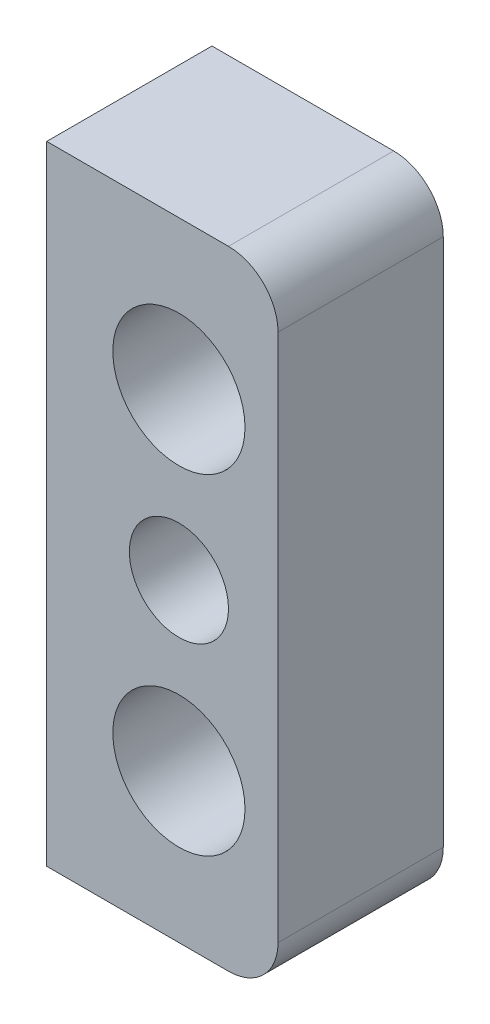
ISO-10303-21;
HEADER;
FILE_DESCRIPTION(('STEP AP214'),'2;1');
FILE_NAME('part.step','',(''),(''),'','','');
FILE_SCHEMA(('AUTOMOTIVE_DESIGN { 1 0 10303 214 1 1 1 1 }'));
ENDSEC;
DATA;
#1=APPLICATION_CONTEXT('core data for automotive mechanical design processes');
#2=APPLICATION_PROTOCOL_DEFINITION('international standard','automotive_design',2000,#1);
#3=PRODUCT_CONTEXT('',#1,'mechanical');
#4=PRODUCT('Part','Part','',(#3));
#5=PRODUCT_RELATED_PRODUCT_CATEGORY('part','',(#4));
#6=PRODUCT_DEFINITION_FORMATION('','',#4);
#7=PRODUCT_DEFINITION_CONTEXT('part definition',#1,'design');
#8=PRODUCT_DEFINITION('design','',#6,#7);
#9=PRODUCT_DEFINITION_SHAPE('','',#8);
#10=(LENGTH_UNIT() NAMED_UNIT(*) SI_UNIT(.MILLI.,.METRE.));
#11=(NAMED_UNIT(*) PLANE_ANGLE_UNIT() SI_UNIT($,.RADIAN.));
#12=(NAMED_UNIT(*) SI_UNIT($,.STERADIAN.) SOLID_ANGLE_UNIT());
#13=UNCERTAINTY_MEASURE_WITH_UNIT(LENGTH_MEASURE(1.E-05),#10,'distance_accuracy_value','');
#14=(GEOMETRIC_REPRESENTATION_CONTEXT(3) GLOBAL_UNCERTAINTY_ASSIGNED_CONTEXT((#13)) GLOBAL_UNIT_ASSIGNED_CONTEXT((#10,
#11,#12)) REPRESENTATION_CONTEXT('',''));
#15=CARTESIAN_POINT('',(0.,0.,0.));
#16=DIRECTION('',(0.,0.,1.));
#17=DIRECTION('',(1.,0.,0.));
#18=AXIS2_PLACEMENT_3D('',#15,#16,#17);
#19=CARTESIAN_POINT('',(20.,-9.49999999999999,-5.));
#20=DIRECTION('',(0.,-1.,0.));
#21=DIRECTION('',(0.,0.,-1.));
#22=AXIS2_PLACEMENT_3D('',#19,#20,#21);
#23=PLANE('',#22);
#24=DIRECTION('',(1.,0.,0.));
#25=VECTOR('',#24,1.);
#26=CARTESIAN_POINT('',(20.,-9.49999999999999,0.));
#27=LINE('',#26,#25);
#28=CARTESIAN_POINT('',(20.,-9.49999999999999,0.));
#29=VERTEX_POINT('',#28);
#30=CARTESIAN_POINT('',(25.5,-9.49999999999999,0.));
#31=VERTEX_POINT('',#30);
#32=EDGE_CURVE('E118',#29,#31,#27,.T.);
#33=ORIENTED_EDGE('',*,*,#32,.F.);
#34=DIRECTION('',(0.,0.,1.));
#35=VECTOR('',#34,1.);
#36=CARTESIAN_POINT('',(20.,-9.49999999999999,-5.));
#37=LINE('',#36,#35);
#38=CARTESIAN_POINT('',(20.,-9.49999999999999,-5.));
#39=VERTEX_POINT('',#38);
#40=EDGE_CURVE('E11',#39,#29,#37,.T.);
#41=ORIENTED_EDGE('',*,*,#40,.F.);
#42=DIRECTION('',(1.,0.,0.));
#43=VECTOR('',#42,1.);
#44=CARTESIAN_POINT('',(20.,-9.49999999999999,-5.));
#45=LINE('',#44,#43);
#46=CARTESIAN_POINT('',(25.5,-9.49999999999999,-5.));
#47=VERTEX_POINT('',#46);
#48=EDGE_CURVE('E133',#39,#47,#45,.T.);
#49=ORIENTED_EDGE('',*,*,#48,.T.);
#50=DIRECTION('',(0.,0.,1.));
#51=VECTOR('',#50,1.);
#52=CARTESIAN_POINT('',(25.5,-9.49999999999999,-5.));
#53=LINE('',#52,#51);
#54=EDGE_CURVE('E36',#47,#31,#53,.T.);
#55=ORIENTED_EDGE('',*,*,#54,.T.);
#56=EDGE_LOOP('',(#33,#41,#49,#55));
#57=FACE_BOUND('',#56,.T.);
#58=ADVANCED_FACE('F33',(#57),#23,.T.);
#59=CARTESIAN_POINT('',(20.,-9.49999999999999,-5.));
#60=DIRECTION('',(-1.,0.,0.));
#61=DIRECTION('',(0.,0.,1.));
#62=AXIS2_PLACEMENT_3D('',#59,#60,#61);
#63=PLANE('',#62);
#64=DIRECTION('',(0.,-1.,0.));
#65=VECTOR('',#64,1.);
#66=CARTESIAN_POINT('',(20.,-9.49999999999999,0.));
#67=LINE('',#66,#65);
#68=CARTESIAN_POINT('',(20.,9.5,0.));
#69=VERTEX_POINT('',#68);
#70=EDGE_CURVE('E131',#69,#29,#67,.T.);
#71=ORIENTED_EDGE('',*,*,#70,.F.);
#72=DIRECTION('',(0.,0.,1.));
#73=VECTOR('',#72,1.);
#74=CARTESIAN_POINT('',(20.,9.5,-5.));
#75=LINE('',#74,#73);
#76=CARTESIAN_POINT('',(20.,9.5,-5.));
#77=VERTEX_POINT('',#76);
#78=EDGE_CURVE('E42',#77,#69,#75,.T.);
#79=ORIENTED_EDGE('',*,*,#78,.F.);
#80=DIRECTION('',(0.,-1.,0.));
#81=VECTOR('',#80,1.);
#82=CARTESIAN_POINT('',(20.,-9.49999999999999,-5.));
#83=LINE('',#82,#81);
#84=EDGE_CURVE('E108',#77,#39,#83,.T.);
#85=ORIENTED_EDGE('',*,*,#84,.T.);
#86=ORIENTED_EDGE('',*,*,#40,.T.);
#87=EDGE_LOOP('',(#71,#79,#85,#86));
#88=FACE_BOUND('',#87,.T.);
#89=ADVANCED_FACE('F141',(#88),#63,.T.);
#90=CARTESIAN_POINT('',(20.,9.5,-5.));
#91=DIRECTION('',(0.,1.,0.));
#92=DIRECTION('',(0.,0.,1.));
#93=AXIS2_PLACEMENT_3D('',#90,#91,#92);
#94=PLANE('',#93);
#95=DIRECTION('',(-1.,0.,0.));
#96=VECTOR('',#95,1.);
#97=CARTESIAN_POINT('',(20.,9.5,0.));
#98=LINE('',#97,#96);
#99=CARTESIAN_POINT('',(25.5,9.5,0.));
#100=VERTEX_POINT('',#99);
#101=EDGE_CURVE('E95',#100,#69,#98,.T.);
#102=ORIENTED_EDGE('',*,*,#101,.F.);
#103=DIRECTION('',(0.,0.,1.));
#104=VECTOR('',#103,1.);
#105=CARTESIAN_POINT('',(25.5,9.5,-5.));
#106=LINE('',#105,#104);
#107=CARTESIAN_POINT('',(25.5,9.5,-5.));
#108=VERTEX_POINT('',#107);
#109=EDGE_CURVE('E90',#108,#100,#106,.T.);
#110=ORIENTED_EDGE('',*,*,#109,.F.);
#111=DIRECTION('',(-1.,0.,0.));
#112=VECTOR('',#111,1.);
#113=CARTESIAN_POINT('',(20.,9.5,-5.));
#114=LINE('',#113,#112);
#115=EDGE_CURVE('E93',#108,#77,#114,.T.);
#116=ORIENTED_EDGE('',*,*,#115,.T.);
#117=ORIENTED_EDGE('',*,*,#78,.T.);
#118=EDGE_LOOP('',(#102,#110,#116,#117));
#119=FACE_BOUND('',#118,.T.);
#120=ADVANCED_FACE('F92',(#119),#94,.T.);
#121=CARTESIAN_POINT('',(25.5,8.,-5.));
#122=DIRECTION('',(0.,0.,1.));
#123=DIRECTION('',(1.,0.,0.));
#124=AXIS2_PLACEMENT_3D('',#121,#122,#123);
#125=CYLINDRICAL_SURFACE('',#124,1.5);
#126=CARTESIAN_POINT('',(25.5,8.,0.));
#127=DIRECTION('',(0.,0.,1.));
#128=DIRECTION('',(-1.,0.,0.));
#129=AXIS2_PLACEMENT_3D('',#126,#127,#128);
#130=CIRCLE('',#129,1.5);
#131=CARTESIAN_POINT('',(27.,7.99999999999999,0.));
#132=VERTEX_POINT('',#131);
#133=EDGE_CURVE('E128',#132,#100,#130,.T.);
#134=ORIENTED_EDGE('',*,*,#133,.F.);
#135=DIRECTION('',(0.,0.,1.));
#136=VECTOR('',#135,1.);
#137=CARTESIAN_POINT('',(27.,7.99999999999999,-5.));
#138=LINE('',#137,#136);
#139=CARTESIAN_POINT('',(27.,7.99999999999999,-5.));
#140=VERTEX_POINT('',#139);
#141=EDGE_CURVE('E100',#140,#132,#138,.T.);
#142=ORIENTED_EDGE('',*,*,#141,.F.);
#143=CARTESIAN_POINT('',(25.5,8.,-5.));
#144=DIRECTION('',(0.,0.,1.));
#145=DIRECTION('',(-1.,0.,0.));
#146=AXIS2_PLACEMENT_3D('',#143,#144,#145);
#147=CIRCLE('',#146,1.5);
#148=EDGE_CURVE('E106',#140,#108,#147,.T.);
#149=ORIENTED_EDGE('',*,*,#148,.T.);
#150=ORIENTED_EDGE('',*,*,#109,.T.);
#151=EDGE_LOOP('',(#134,#142,#149,#150));
#152=FACE_BOUND('',#151,.T.);
#153=ADVANCED_FACE('F110',(#152),#125,.T.);
#154=CARTESIAN_POINT('',(27.,-7.99999999999998,-5.));
#155=DIRECTION('',(1.,0.,0.));
#156=DIRECTION('',(0.,0.,-1.));
#157=AXIS2_PLACEMENT_3D('',#154,#155,#156);
#158=PLANE('',#157);
#159=DIRECTION('',(0.,1.,0.));
#160=VECTOR('',#159,1.);
#161=CARTESIAN_POINT('',(27.,-7.99999999999998,0.));
#162=LINE('',#161,#160);
#163=CARTESIAN_POINT('',(27.,-7.99999999999998,0.));
#164=VERTEX_POINT('',#163);
#165=EDGE_CURVE('E125',#164,#132,#162,.T.);
#166=ORIENTED_EDGE('',*,*,#165,.F.);
#167=DIRECTION('',(0.,0.,1.));
#168=VECTOR('',#167,1.);
#169=CARTESIAN_POINT('',(27.,-7.99999999999998,-5.));
#170=LINE('',#169,#168);
#171=CARTESIAN_POINT('',(27.,-7.99999999999998,-5.));
#172=VERTEX_POINT('',#171);
#173=EDGE_CURVE('E136',#172,#164,#170,.T.);
#174=ORIENTED_EDGE('',*,*,#173,.F.);
#175=DIRECTION('',(0.,1.,0.));
#176=VECTOR('',#175,1.);
#177=CARTESIAN_POINT('',(27.,-7.99999999999998,-5.));
#178=LINE('',#177,#176);
#179=EDGE_CURVE('E111',#172,#140,#178,.T.);
#180=ORIENTED_EDGE('',*,*,#179,.T.);
#181=ORIENTED_EDGE('',*,*,#141,.T.);
#182=EDGE_LOOP('',(#166,#174,#180,#181));
#183=FACE_BOUND('',#182,.T.);
#184=ADVANCED_FACE('F154',(#183),#158,.T.);
#185=CARTESIAN_POINT('',(25.5,-7.99999999999999,-5.));
#186=DIRECTION('',(0.,0.,1.));
#187=DIRECTION('',(1.,0.,0.));
#188=AXIS2_PLACEMENT_3D('',#185,#186,#187);
#189=CYLINDRICAL_SURFACE('',#188,1.5);
#190=CARTESIAN_POINT('',(25.5,-7.99999999999999,0.));
#191=DIRECTION('',(0.,0.,1.));
#192=DIRECTION('',(1.,0.,0.));
#193=AXIS2_PLACEMENT_3D('',#190,#191,#192);
#194=CIRCLE('',#193,1.5);
#195=EDGE_CURVE('E121',#31,#164,#194,.T.);
#196=ORIENTED_EDGE('',*,*,#195,.F.);
#197=ORIENTED_EDGE('',*,*,#54,.F.);
#198=CARTESIAN_POINT('',(25.5,-7.99999999999999,-5.));
#199=DIRECTION('',(0.,0.,1.));
#200=DIRECTION('',(1.,0.,0.));
#201=AXIS2_PLACEMENT_3D('',#198,#199,#200);
#202=CIRCLE('',#201,1.5);
#203=EDGE_CURVE('E113',#47,#172,#202,.T.);
#204=ORIENTED_EDGE('',*,*,#203,.T.);
#205=ORIENTED_EDGE('',*,*,#173,.T.);
#206=EDGE_LOOP('',(#196,#197,#204,#205));
#207=FACE_BOUND('',#206,.T.);
#208=ADVANCED_FACE('F138',(#207),#189,.T.);
#209=CARTESIAN_POINT('',(25.5,-7.99999999999999,-5.));
#210=DIRECTION('',(0.,0.,1.));
#211=DIRECTION('',(1.,0.,0.));
#212=AXIS2_PLACEMENT_3D('',#209,#210,#211);
#213=PLANE('',#212);
#214=CARTESIAN_POINT('',(24.,0.,-5.));
#215=DIRECTION('',(0.,0.,1.));
#216=DIRECTION('',(1.,0.,0.));
#217=AXIS2_PLACEMENT_3D('',#214,#215,#216);
#218=CIRCLE('',#217,1.5);
#219=CARTESIAN_POINT('',(25.5,0.,-5.));
#220=VERTEX_POINT('',#219);
#221=EDGE_CURVE('E184',#220,#220,#218,.T.);
#222=ORIENTED_EDGE('',*,*,#221,.T.);
#223=EDGE_LOOP('',(#222));
#224=FACE_BOUND('',#223,.T.);
#225=CARTESIAN_POINT('',(24.,-5.,-5.));
#226=DIRECTION('',(0.,0.,1.));
#227=DIRECTION('',(1.,0.,0.));
#228=AXIS2_PLACEMENT_3D('',#225,#226,#227);
#229=CIRCLE('',#228,2.00000000000001);
#230=CARTESIAN_POINT('',(26.,-5.,-5.));
#231=VERTEX_POINT('',#230);
#232=EDGE_CURVE('E192',#231,#231,#229,.T.);
#233=ORIENTED_EDGE('',*,*,#232,.T.);
#234=EDGE_LOOP('',(#233));
#235=FACE_BOUND('',#234,.T.);
#236=CARTESIAN_POINT('',(24.,5.,-5.));
#237=DIRECTION('',(0.,0.,1.));
#238=DIRECTION('',(1.,0.,0.));
#239=AXIS2_PLACEMENT_3D('',#236,#237,#238);
#240=CIRCLE('',#239,1.99999999999999);
#241=CARTESIAN_POINT('',(26.,5.,-5.));
#242=VERTEX_POINT('',#241);
#243=EDGE_CURVE('E122',#242,#242,#240,.T.);
#244=ORIENTED_EDGE('',*,*,#243,.T.);
#245=EDGE_LOOP('',(#244));
#246=FACE_BOUND('',#245,.T.);
#247=ORIENTED_EDGE('',*,*,#48,.F.);
#248=ORIENTED_EDGE('',*,*,#84,.F.);
#249=ORIENTED_EDGE('',*,*,#115,.F.);
#250=ORIENTED_EDGE('',*,*,#148,.F.);
#251=ORIENTED_EDGE('',*,*,#179,.F.);
#252=ORIENTED_EDGE('',*,*,#203,.F.);
#253=EDGE_LOOP('',(#247,#248,#249,#250,#251,#252));
#254=FACE_BOUND('',#253,.T.);
#255=ADVANCED_FACE('F104',(#224,#235,#246,#254),#213,.F.);
#256=CARTESIAN_POINT('',(25.5,-7.99999999999999,0.));
#257=DIRECTION('',(0.,0.,1.));
#258=DIRECTION('',(1.,0.,0.));
#259=AXIS2_PLACEMENT_3D('',#256,#257,#258);
#260=PLANE('',#259);
#261=CARTESIAN_POINT('',(24.,0.,0.));
#262=DIRECTION('',(0.,0.,1.));
#263=DIRECTION('',(1.,0.,0.));
#264=AXIS2_PLACEMENT_3D('',#261,#262,#263);
#265=CIRCLE('',#264,1.5);
#266=CARTESIAN_POINT('',(25.5,0.,0.));
#267=VERTEX_POINT('',#266);
#268=EDGE_CURVE('E187',#267,#267,#265,.T.);
#269=ORIENTED_EDGE('',*,*,#268,.F.);
#270=EDGE_LOOP('',(#269));
#271=FACE_BOUND('',#270,.T.);
#272=CARTESIAN_POINT('',(24.,-5.,0.));
#273=DIRECTION('',(0.,0.,1.));
#274=DIRECTION('',(1.,0.,0.));
#275=AXIS2_PLACEMENT_3D('',#272,#273,#274);
#276=CIRCLE('',#275,2.00000000000001);
#277=CARTESIAN_POINT('',(26.,-5.,0.));
#278=VERTEX_POINT('',#277);
#279=EDGE_CURVE('E189',#278,#278,#276,.T.);
#280=ORIENTED_EDGE('',*,*,#279,.F.);
#281=EDGE_LOOP('',(#280));
#282=FACE_BOUND('',#281,.T.);
#283=CARTESIAN_POINT('',(24.,5.,0.));
#284=DIRECTION('',(0.,0.,1.));
#285=DIRECTION('',(1.,0.,0.));
#286=AXIS2_PLACEMENT_3D('',#283,#284,#285);
#287=CIRCLE('',#286,1.99999999999999);
#288=CARTESIAN_POINT('',(26.,5.,0.));
#289=VERTEX_POINT('',#288);
#290=EDGE_CURVE('E195',#289,#289,#287,.T.);
#291=ORIENTED_EDGE('',*,*,#290,.F.);
#292=EDGE_LOOP('',(#291));
#293=FACE_BOUND('',#292,.T.);
#294=ORIENTED_EDGE('',*,*,#32,.T.);
#295=ORIENTED_EDGE('',*,*,#195,.T.);
#296=ORIENTED_EDGE('',*,*,#165,.T.);
#297=ORIENTED_EDGE('',*,*,#133,.T.);
#298=ORIENTED_EDGE('',*,*,#101,.T.);
#299=ORIENTED_EDGE('',*,*,#70,.T.);
#300=EDGE_LOOP('',(#294,#295,#296,#297,#298,#299));
#301=FACE_BOUND('',#300,.T.);
#302=ADVANCED_FACE('F140',(#271,#282,#293,#301),#260,.T.);
#303=CARTESIAN_POINT('',(24.,5.,-5.));
#304=DIRECTION('',(0.,0.,1.));
#305=DIRECTION('',(1.,0.,0.));
#306=AXIS2_PLACEMENT_3D('',#303,#304,#305);
#307=CYLINDRICAL_SURFACE('',#306,1.99999999999999);
#308=ORIENTED_EDGE('',*,*,#243,.F.);
#309=EDGE_LOOP('',(#308));
#310=FACE_BOUND('',#309,.T.);
#311=ORIENTED_EDGE('',*,*,#290,.T.);
#312=EDGE_LOOP('',(#311));
#313=FACE_BOUND('',#312,.T.);
#314=ADVANCED_FACE('F165',(#310,#313),#307,.F.);
#315=CARTESIAN_POINT('',(24.,-5.,-5.));
#316=DIRECTION('',(0.,0.,1.));
#317=DIRECTION('',(1.,0.,0.));
#318=AXIS2_PLACEMENT_3D('',#315,#316,#317);
#319=CYLINDRICAL_SURFACE('',#318,2.00000000000001);
#320=ORIENTED_EDGE('',*,*,#232,.F.);
#321=EDGE_LOOP('',(#320));
#322=FACE_BOUND('',#321,.T.);
#323=ORIENTED_EDGE('',*,*,#279,.T.);
#324=EDGE_LOOP('',(#323));
#325=FACE_BOUND('',#324,.T.);
#326=ADVANCED_FACE('F172',(#322,#325),#319,.F.);
#327=CARTESIAN_POINT('',(24.,0.,-5.));
#328=DIRECTION('',(0.,0.,1.));
#329=DIRECTION('',(1.,0.,0.));
#330=AXIS2_PLACEMENT_3D('',#327,#328,#329);
#331=CYLINDRICAL_SURFACE('',#330,1.5);
#332=ORIENTED_EDGE('',*,*,#221,.F.);
#333=EDGE_LOOP('',(#332));
#334=FACE_BOUND('',#333,.T.);
#335=ORIENTED_EDGE('',*,*,#268,.T.);
#336=EDGE_LOOP('',(#335));
#337=FACE_BOUND('',#336,.T.);
#338=ADVANCED_FACE('F176',(#334,#337),#331,.F.);
#339=CLOSED_SHELL('',(#58,#89,#120,#153,#184,#208,#255,#302,#314,#326,#338));
#340=MANIFOLD_SOLID_BREP('B2',#339);
#341=ADVANCED_BREP_SHAPE_REPRESENTATION('',(#18,#340),#14);
#342=SHAPE_DEFINITION_REPRESENTATION(#9,#341);
ENDSEC;
END-ISO-10303-21;
